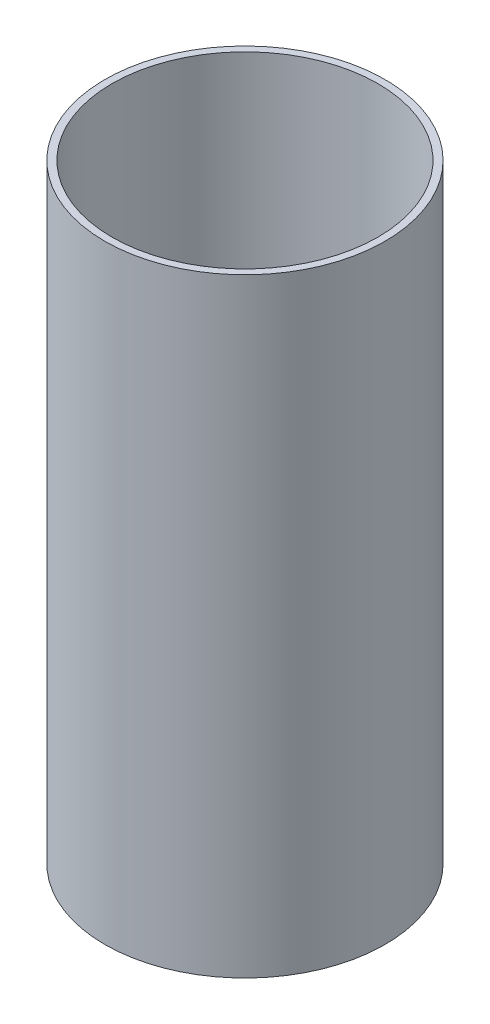
ISO-10303-21;
HEADER;
FILE_DESCRIPTION(('STEP AP214'),'2;1');
FILE_NAME('part.step','',(''),(''),'','','');
FILE_SCHEMA(('AUTOMOTIVE_DESIGN { 1 0 10303 214 1 1 1 1 }'));
ENDSEC;
DATA;
#1=APPLICATION_CONTEXT('core data for automotive mechanical design processes');
#2=APPLICATION_PROTOCOL_DEFINITION('international standard','automotive_design',2000,#1);
#3=PRODUCT_CONTEXT('',#1,'mechanical');
#4=PRODUCT('Part','Part','',(#3));
#5=PRODUCT_RELATED_PRODUCT_CATEGORY('part','',(#4));
#6=PRODUCT_DEFINITION_FORMATION('','',#4);
#7=PRODUCT_DEFINITION_CONTEXT('part definition',#1,'design');
#8=PRODUCT_DEFINITION('design','',#6,#7);
#9=PRODUCT_DEFINITION_SHAPE('','',#8);
#10=(LENGTH_UNIT() NAMED_UNIT(*) SI_UNIT(.MILLI.,.METRE.));
#11=(NAMED_UNIT(*) PLANE_ANGLE_UNIT() SI_UNIT($,.RADIAN.));
#12=(NAMED_UNIT(*) SI_UNIT($,.STERADIAN.) SOLID_ANGLE_UNIT());
#13=UNCERTAINTY_MEASURE_WITH_UNIT(LENGTH_MEASURE(1.E-05),#10,'distance_accuracy_value','');
#14=(GEOMETRIC_REPRESENTATION_CONTEXT(3) GLOBAL_UNCERTAINTY_ASSIGNED_CONTEXT((#13)) GLOBAL_UNIT_ASSIGNED_CONTEXT((#10,
#11,#12)) REPRESENTATION_CONTEXT('',''));
#15=CARTESIAN_POINT('',(0.,0.,0.));
#16=DIRECTION('',(0.,0.,1.));
#17=DIRECTION('',(1.,0.,0.));
#18=AXIS2_PLACEMENT_3D('',#15,#16,#17);
#19=CARTESIAN_POINT('',(0.,203.581,0.));
#20=DIRECTION('',(0.,1.,0.));
#21=DIRECTION('',(0.,0.,1.));
#22=AXIS2_PLACEMENT_3D('',#19,#20,#21);
#23=PLANE('',#22);
#24=CARTESIAN_POINT('',(0.,203.581,0.));
#25=DIRECTION('',(0.,1.,0.));
#26=DIRECTION('',(0.,0.,1.));
#27=AXIS2_PLACEMENT_3D('',#24,#25,#26);
#28=CIRCLE('',#27,93.6625);
#29=CARTESIAN_POINT('',(0.,203.581,93.6625));
#30=VERTEX_POINT('',#29);
#31=EDGE_CURVE('E10',#30,#30,#28,.T.);
#32=ORIENTED_EDGE('',*,*,#31,.T.);
#33=EDGE_LOOP('',(#32));
#34=FACE_BOUND('',#33,.T.);
#35=CARTESIAN_POINT('',(0.,203.581,0.));
#36=DIRECTION('',(0.,1.,0.));
#37=DIRECTION('',(0.,0.,1.));
#38=AXIS2_PLACEMENT_3D('',#35,#36,#37);
#39=CIRCLE('',#38,88.9);
#40=CARTESIAN_POINT('',(0.,203.581,88.9));
#41=VERTEX_POINT('',#40);
#42=EDGE_CURVE('E50',#41,#41,#39,.T.);
#43=ORIENTED_EDGE('',*,*,#42,.F.);
#44=EDGE_LOOP('',(#43));
#45=FACE_BOUND('',#44,.T.);
#46=ADVANCED_FACE('F37',(#34,#45),#23,.T.);
#47=CARTESIAN_POINT('',(0.,-203.581,0.));
#48=DIRECTION('',(0.,1.,0.));
#49=DIRECTION('',(0.,0.,1.));
#50=AXIS2_PLACEMENT_3D('',#47,#48,#49);
#51=PLANE('',#50);
#52=CARTESIAN_POINT('',(0.,-203.581,0.));
#53=DIRECTION('',(0.,1.,0.));
#54=DIRECTION('',(0.,0.,1.));
#55=AXIS2_PLACEMENT_3D('',#52,#53,#54);
#56=CIRCLE('',#55,93.6625);
#57=CARTESIAN_POINT('',(0.,-203.581,93.6625));
#58=VERTEX_POINT('',#57);
#59=EDGE_CURVE('E41',#58,#58,#56,.T.);
#60=ORIENTED_EDGE('',*,*,#59,.F.);
#61=EDGE_LOOP('',(#60));
#62=FACE_BOUND('',#61,.T.);
#63=CARTESIAN_POINT('',(0.,-203.581,0.));
#64=DIRECTION('',(0.,1.,0.));
#65=DIRECTION('',(0.,0.,1.));
#66=AXIS2_PLACEMENT_3D('',#63,#64,#65);
#67=CIRCLE('',#66,88.9);
#68=CARTESIAN_POINT('',(0.,-203.581,88.9));
#69=VERTEX_POINT('',#68);
#70=EDGE_CURVE('E52',#69,#69,#67,.T.);
#71=ORIENTED_EDGE('',*,*,#70,.T.);
#72=EDGE_LOOP('',(#71));
#73=FACE_BOUND('',#72,.T.);
#74=ADVANCED_FACE('F64',(#62,#73),#51,.F.);
#75=CARTESIAN_POINT('',(0.,203.581,0.));
#76=DIRECTION('',(0.,-1.,0.));
#77=DIRECTION('',(0.,0.,-1.));
#78=AXIS2_PLACEMENT_3D('',#75,#76,#77);
#79=CYLINDRICAL_SURFACE('',#78,93.6625);
#80=ORIENTED_EDGE('',*,*,#31,.F.);
#81=EDGE_LOOP('',(#80));
#82=FACE_BOUND('',#81,.T.);
#83=ORIENTED_EDGE('',*,*,#59,.T.);
#84=EDGE_LOOP('',(#83));
#85=FACE_BOUND('',#84,.T.);
#86=ADVANCED_FACE('F39',(#82,#85),#79,.T.);
#87=CARTESIAN_POINT('',(0.,203.581,0.));
#88=DIRECTION('',(0.,-1.,0.));
#89=DIRECTION('',(0.,0.,-1.));
#90=AXIS2_PLACEMENT_3D('',#87,#88,#89);
#91=CYLINDRICAL_SURFACE('',#90,88.9);
#92=ORIENTED_EDGE('',*,*,#42,.T.);
#93=EDGE_LOOP('',(#92));
#94=FACE_BOUND('',#93,.T.);
#95=ORIENTED_EDGE('',*,*,#70,.F.);
#96=EDGE_LOOP('',(#95));
#97=FACE_BOUND('',#96,.T.);
#98=ADVANCED_FACE('F60',(#94,#97),#91,.F.);
#99=CLOSED_SHELL('',(#46,#74,#86,#98));
#100=MANIFOLD_SOLID_BREP('B2',#99);
#101=ADVANCED_BREP_SHAPE_REPRESENTATION('',(#18,#100),#14);
#102=SHAPE_DEFINITION_REPRESENTATION(#9,#101);
ENDSEC;
END-ISO-10303-21;
